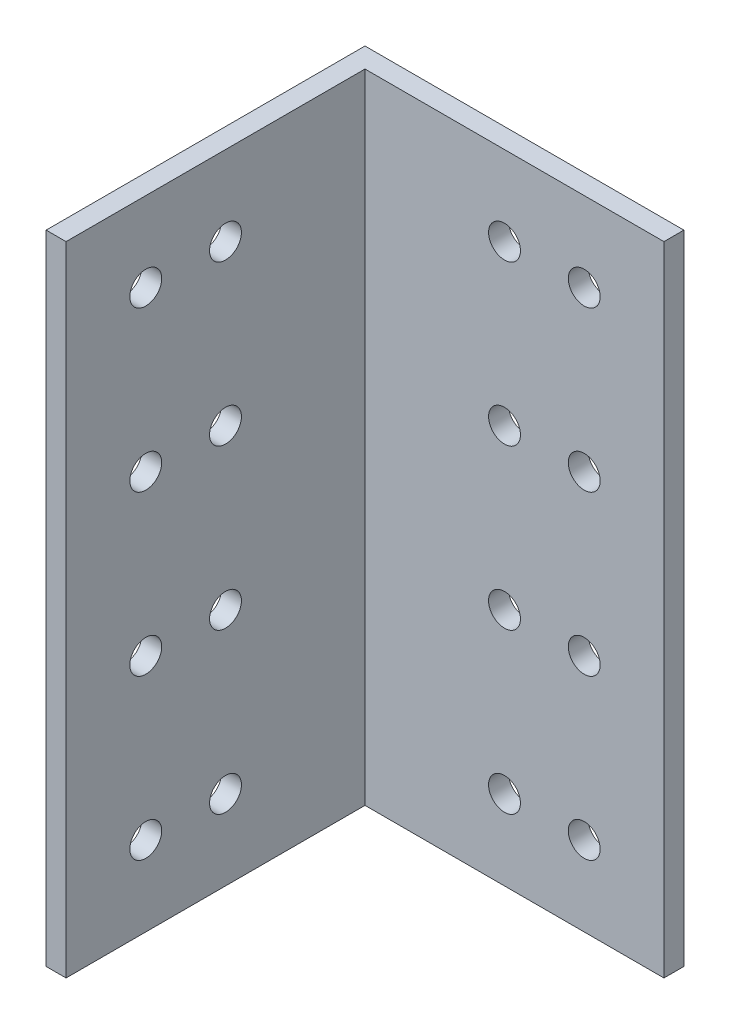
ISO-10303-21;
HEADER;
FILE_DESCRIPTION(('STEP AP214'),'2;1');
FILE_NAME('part.step','',(''),(''),'','','');
FILE_SCHEMA(('AUTOMOTIVE_DESIGN { 1 0 10303 214 1 1 1 1 }'));
ENDSEC;
DATA;
#1=APPLICATION_CONTEXT('core data for automotive mechanical design processes');
#2=APPLICATION_PROTOCOL_DEFINITION('international standard','automotive_design',2000,#1);
#3=PRODUCT_CONTEXT('',#1,'mechanical');
#4=PRODUCT('Part','Part','',(#3));
#5=PRODUCT_RELATED_PRODUCT_CATEGORY('part','',(#4));
#6=PRODUCT_DEFINITION_FORMATION('','',#4);
#7=PRODUCT_DEFINITION_CONTEXT('part definition',#1,'design');
#8=PRODUCT_DEFINITION('design','',#6,#7);
#9=PRODUCT_DEFINITION_SHAPE('','',#8);
#10=(LENGTH_UNIT() NAMED_UNIT(*) SI_UNIT(.MILLI.,.METRE.));
#11=(NAMED_UNIT(*) PLANE_ANGLE_UNIT() SI_UNIT($,.RADIAN.));
#12=(NAMED_UNIT(*) SI_UNIT($,.STERADIAN.) SOLID_ANGLE_UNIT());
#13=UNCERTAINTY_MEASURE_WITH_UNIT(LENGTH_MEASURE(1.E-05),#10,'distance_accuracy_value','');
#14=(GEOMETRIC_REPRESENTATION_CONTEXT(3) GLOBAL_UNCERTAINTY_ASSIGNED_CONTEXT((#13)) GLOBAL_UNIT_ASSIGNED_CONTEXT((#10,
#11,#12)) REPRESENTATION_CONTEXT('',''));
#15=CARTESIAN_POINT('',(0.,0.,0.));
#16=DIRECTION('',(0.,0.,1.));
#17=DIRECTION('',(1.,0.,0.));
#18=AXIS2_PLACEMENT_3D('',#15,#16,#17);
#19=CARTESIAN_POINT('',(-22.225,101.6,0.));
#20=DIRECTION('',(1.,0.,0.));
#21=DIRECTION('',(0.,0.,-1.));
#22=AXIS2_PLACEMENT_3D('',#19,#20,#21);
#23=PLANE('',#22);
#24=CARTESIAN_POINT('',(-22.225,38.1,12.7));
#25=DIRECTION('',(1.,0.,0.));
#26=DIRECTION('',(0.,0.,-1.));
#27=AXIS2_PLACEMENT_3D('',#24,#25,#26);
#28=CIRCLE('',#27,2.54);
#29=CARTESIAN_POINT('',(-22.225,38.1,10.16));
#30=VERTEX_POINT('',#29);
#31=EDGE_CURVE('E217',#30,#30,#28,.T.);
#32=ORIENTED_EDGE('',*,*,#31,.F.);
#33=EDGE_LOOP('',(#32));
#34=FACE_BOUND('',#33,.T.);
#35=CARTESIAN_POINT('',(-22.225,63.5,0.));
#36=DIRECTION('',(1.,0.,0.));
#37=DIRECTION('',(0.,0.,-1.));
#38=AXIS2_PLACEMENT_3D('',#35,#36,#37);
#39=CIRCLE('',#38,2.53999999999999);
#40=CARTESIAN_POINT('',(-22.225,63.5,-2.53999999999999));
#41=VERTEX_POINT('',#40);
#42=EDGE_CURVE('E224',#41,#41,#39,.T.);
#43=ORIENTED_EDGE('',*,*,#42,.F.);
#44=EDGE_LOOP('',(#43));
#45=FACE_BOUND('',#44,.T.);
#46=CARTESIAN_POINT('',(-22.225,63.5,12.7));
#47=DIRECTION('',(1.,0.,0.));
#48=DIRECTION('',(0.,0.,-1.));
#49=AXIS2_PLACEMENT_3D('',#46,#47,#48);
#50=CIRCLE('',#49,2.53999999999999);
#51=CARTESIAN_POINT('',(-22.225,63.5,10.16));
#52=VERTEX_POINT('',#51);
#53=EDGE_CURVE('E205',#52,#52,#50,.T.);
#54=ORIENTED_EDGE('',*,*,#53,.F.);
#55=EDGE_LOOP('',(#54));
#56=FACE_BOUND('',#55,.T.);
#57=CARTESIAN_POINT('',(-22.225,88.9,0.));
#58=DIRECTION('',(1.,0.,0.));
#59=DIRECTION('',(0.,0.,-1.));
#60=AXIS2_PLACEMENT_3D('',#57,#58,#59);
#61=CIRCLE('',#60,2.53999999999999);
#62=CARTESIAN_POINT('',(-22.225,88.9,-2.54));
#63=VERTEX_POINT('',#62);
#64=EDGE_CURVE('E212',#63,#63,#61,.T.);
#65=ORIENTED_EDGE('',*,*,#64,.F.);
#66=EDGE_LOOP('',(#65));
#67=FACE_BOUND('',#66,.T.);
#68=CARTESIAN_POINT('',(-22.225,12.7,0.));
#69=DIRECTION('',(1.,0.,0.));
#70=DIRECTION('',(0.,0.,-1.));
#71=AXIS2_PLACEMENT_3D('',#68,#69,#70);
#72=CIRCLE('',#71,2.54);
#73=CARTESIAN_POINT('',(-22.225,12.7,-2.54));
#74=VERTEX_POINT('',#73);
#75=EDGE_CURVE('E241',#74,#74,#72,.T.);
#76=ORIENTED_EDGE('',*,*,#75,.F.);
#77=EDGE_LOOP('',(#76));
#78=FACE_BOUND('',#77,.T.);
#79=CARTESIAN_POINT('',(-22.225,12.7,12.7));
#80=DIRECTION('',(1.,0.,0.));
#81=DIRECTION('',(0.,0.,-1.));
#82=AXIS2_PLACEMENT_3D('',#79,#80,#81);
#83=CIRCLE('',#82,2.54);
#84=CARTESIAN_POINT('',(-22.225,12.7,10.16));
#85=VERTEX_POINT('',#84);
#86=EDGE_CURVE('E229',#85,#85,#83,.T.);
#87=ORIENTED_EDGE('',*,*,#86,.F.);
#88=EDGE_LOOP('',(#87));
#89=FACE_BOUND('',#88,.T.);
#90=CARTESIAN_POINT('',(-22.225,38.1,0.));
#91=DIRECTION('',(1.,0.,0.));
#92=DIRECTION('',(0.,0.,-1.));
#93=AXIS2_PLACEMENT_3D('',#90,#91,#92);
#94=CIRCLE('',#93,2.54);
#95=CARTESIAN_POINT('',(-22.225,38.1,-2.54));
#96=VERTEX_POINT('',#95);
#97=EDGE_CURVE('E236',#96,#96,#94,.T.);
#98=ORIENTED_EDGE('',*,*,#97,.F.);
#99=EDGE_LOOP('',(#98));
#100=FACE_BOUND('',#99,.T.);
#101=CARTESIAN_POINT('',(-22.225,88.9,12.7));
#102=DIRECTION('',(1.,0.,0.));
#103=DIRECTION('',(0.,0.,-1.));
#104=AXIS2_PLACEMENT_3D('',#101,#102,#103);
#105=CIRCLE('',#104,2.54);
#106=CARTESIAN_POINT('',(-22.225,88.9,10.16));
#107=VERTEX_POINT('',#106);
#108=EDGE_CURVE('E199',#107,#107,#105,.T.);
#109=ORIENTED_EDGE('',*,*,#108,.F.);
#110=EDGE_LOOP('',(#109));
#111=FACE_BOUND('',#110,.T.);
#112=DIRECTION('',(0.,0.,1.));
#113=VECTOR('',#112,1.);
#114=CARTESIAN_POINT('',(-22.225,0.,0.));
#115=LINE('',#114,#113);
#116=CARTESIAN_POINT('',(-22.225,0.,-22.225));
#117=VERTEX_POINT('',#116);
#118=CARTESIAN_POINT('',(-22.225,0.,25.4));
#119=VERTEX_POINT('',#118);
#120=EDGE_CURVE('E120',#117,#119,#115,.T.);
#121=ORIENTED_EDGE('',*,*,#120,.F.);
#122=DIRECTION('',(0.,-1.,0.));
#123=VECTOR('',#122,1.);
#124=CARTESIAN_POINT('',(-22.225,101.6,-22.225));
#125=LINE('',#124,#123);
#126=CARTESIAN_POINT('',(-22.225,101.6,-22.225));
#127=VERTEX_POINT('',#126);
#128=EDGE_CURVE('E11',#127,#117,#125,.T.);
#129=ORIENTED_EDGE('',*,*,#128,.F.);
#130=DIRECTION('',(0.,0.,1.));
#131=VECTOR('',#130,1.);
#132=CARTESIAN_POINT('',(-22.225,101.6,0.));
#133=LINE('',#132,#131);
#134=CARTESIAN_POINT('',(-22.225,101.6,25.4));
#135=VERTEX_POINT('',#134);
#136=EDGE_CURVE('E134',#127,#135,#133,.T.);
#137=ORIENTED_EDGE('',*,*,#136,.T.);
#138=DIRECTION('',(0.,-1.,0.));
#139=VECTOR('',#138,1.);
#140=CARTESIAN_POINT('',(-22.225,101.6,25.4));
#141=LINE('',#140,#139);
#142=EDGE_CURVE('E83',#135,#119,#141,.T.);
#143=ORIENTED_EDGE('',*,*,#142,.T.);
#144=EDGE_LOOP('',(#121,#129,#137,#143));
#145=FACE_BOUND('',#144,.T.);
#146=ADVANCED_FACE('F39',(#34,#45,#56,#67,#78,#89,#100,#111,#145),#23,.T.);
#147=CARTESIAN_POINT('',(0.,101.6,-22.225));
#148=DIRECTION('',(0.,0.,-1.));
#149=DIRECTION('',(-1.,0.,0.));
#150=AXIS2_PLACEMENT_3D('',#147,#148,#149);
#151=PLANE('',#150);
#152=CARTESIAN_POINT('',(0.,38.1,-22.225));
#153=DIRECTION('',(0.,0.,1.));
#154=DIRECTION('',(1.,0.,0.));
#155=AXIS2_PLACEMENT_3D('',#152,#153,#154);
#156=CIRCLE('',#155,2.54);
#157=CARTESIAN_POINT('',(2.54,38.1,-22.225));
#158=VERTEX_POINT('',#157);
#159=EDGE_CURVE('E169',#158,#158,#156,.T.);
#160=ORIENTED_EDGE('',*,*,#159,.F.);
#161=EDGE_LOOP('',(#160));
#162=FACE_BOUND('',#161,.T.);
#163=CARTESIAN_POINT('',(12.7,63.5,-22.225));
#164=DIRECTION('',(0.,0.,1.));
#165=DIRECTION('',(1.,0.,0.));
#166=AXIS2_PLACEMENT_3D('',#163,#164,#165);
#167=CIRCLE('',#166,2.54);
#168=CARTESIAN_POINT('',(15.24,63.5,-22.225));
#169=VERTEX_POINT('',#168);
#170=EDGE_CURVE('E176',#169,#169,#167,.T.);
#171=ORIENTED_EDGE('',*,*,#170,.F.);
#172=EDGE_LOOP('',(#171));
#173=FACE_BOUND('',#172,.T.);
#174=CARTESIAN_POINT('',(0.,63.5,-22.225));
#175=DIRECTION('',(0.,0.,1.));
#176=DIRECTION('',(1.,0.,0.));
#177=AXIS2_PLACEMENT_3D('',#174,#175,#176);
#178=CIRCLE('',#177,2.53999999999999);
#179=CARTESIAN_POINT('',(2.53999999999999,63.5,-22.225));
#180=VERTEX_POINT('',#179);
#181=EDGE_CURVE('E157',#180,#180,#178,.T.);
#182=ORIENTED_EDGE('',*,*,#181,.F.);
#183=EDGE_LOOP('',(#182));
#184=FACE_BOUND('',#183,.T.);
#185=CARTESIAN_POINT('',(0.,88.9,-22.225));
#186=DIRECTION('',(0.,0.,1.));
#187=DIRECTION('',(1.,0.,0.));
#188=AXIS2_PLACEMENT_3D('',#185,#186,#187);
#189=CIRCLE('',#188,2.53999999999999);
#190=CARTESIAN_POINT('',(2.53999999999999,88.9,-22.225));
#191=VERTEX_POINT('',#190);
#192=EDGE_CURVE('E164',#191,#191,#189,.T.);
#193=ORIENTED_EDGE('',*,*,#192,.F.);
#194=EDGE_LOOP('',(#193));
#195=FACE_BOUND('',#194,.T.);
#196=CARTESIAN_POINT('',(12.7,12.7,-22.225));
#197=DIRECTION('',(0.,0.,1.));
#198=DIRECTION('',(1.,0.,0.));
#199=AXIS2_PLACEMENT_3D('',#196,#197,#198);
#200=CIRCLE('',#199,2.54);
#201=CARTESIAN_POINT('',(15.24,12.7,-22.225));
#202=VERTEX_POINT('',#201);
#203=EDGE_CURVE('E193',#202,#202,#200,.T.);
#204=ORIENTED_EDGE('',*,*,#203,.F.);
#205=EDGE_LOOP('',(#204));
#206=FACE_BOUND('',#205,.T.);
#207=CARTESIAN_POINT('',(0.,12.7,-22.225));
#208=DIRECTION('',(0.,0.,1.));
#209=DIRECTION('',(1.,0.,0.));
#210=AXIS2_PLACEMENT_3D('',#207,#208,#209);
#211=CIRCLE('',#210,2.54);
#212=CARTESIAN_POINT('',(2.54,12.7,-22.225));
#213=VERTEX_POINT('',#212);
#214=EDGE_CURVE('E181',#213,#213,#211,.T.);
#215=ORIENTED_EDGE('',*,*,#214,.F.);
#216=EDGE_LOOP('',(#215));
#217=FACE_BOUND('',#216,.T.);
#218=CARTESIAN_POINT('',(12.7,38.1,-22.225));
#219=DIRECTION('',(0.,0.,1.));
#220=DIRECTION('',(1.,0.,0.));
#221=AXIS2_PLACEMENT_3D('',#218,#219,#220);
#222=CIRCLE('',#221,2.54);
#223=CARTESIAN_POINT('',(15.24,38.1,-22.225));
#224=VERTEX_POINT('',#223);
#225=EDGE_CURVE('E188',#224,#224,#222,.T.);
#226=ORIENTED_EDGE('',*,*,#225,.F.);
#227=EDGE_LOOP('',(#226));
#228=FACE_BOUND('',#227,.T.);
#229=CARTESIAN_POINT('',(12.7,88.9,-22.225));
#230=DIRECTION('',(0.,0.,1.));
#231=DIRECTION('',(1.,0.,0.));
#232=AXIS2_PLACEMENT_3D('',#229,#230,#231);
#233=CIRCLE('',#232,2.53999999999999);
#234=CARTESIAN_POINT('',(15.24,88.9,-22.225));
#235=VERTEX_POINT('',#234);
#236=EDGE_CURVE('E151',#235,#235,#233,.T.);
#237=ORIENTED_EDGE('',*,*,#236,.F.);
#238=EDGE_LOOP('',(#237));
#239=FACE_BOUND('',#238,.T.);
#240=DIRECTION('',(1.,0.,0.));
#241=VECTOR('',#240,1.);
#242=CARTESIAN_POINT('',(0.,0.,-22.225));
#243=LINE('',#242,#241);
#244=CARTESIAN_POINT('',(25.4,0.,-22.225));
#245=VERTEX_POINT('',#244);
#246=EDGE_CURVE('E123',#117,#245,#243,.T.);
#247=ORIENTED_EDGE('',*,*,#246,.T.);
#248=DIRECTION('',(0.,-1.,0.));
#249=VECTOR('',#248,1.);
#250=CARTESIAN_POINT('',(25.4,101.6,-22.225));
#251=LINE('',#250,#249);
#252=CARTESIAN_POINT('',(25.4,101.6,-22.225));
#253=VERTEX_POINT('',#252);
#254=EDGE_CURVE('E47',#253,#245,#251,.T.);
#255=ORIENTED_EDGE('',*,*,#254,.F.);
#256=DIRECTION('',(1.,0.,0.));
#257=VECTOR('',#256,1.);
#258=CARTESIAN_POINT('',(0.,101.6,-22.225));
#259=LINE('',#258,#257);
#260=EDGE_CURVE('E147',#127,#253,#259,.T.);
#261=ORIENTED_EDGE('',*,*,#260,.F.);
#262=ORIENTED_EDGE('',*,*,#128,.T.);
#263=EDGE_LOOP('',(#247,#255,#261,#262));
#264=FACE_BOUND('',#263,.T.);
#265=ADVANCED_FACE('F259',(#162,#173,#184,#195,#206,#217,#228,#239,#264),#151,.F.);
#266=CARTESIAN_POINT('',(25.4,101.6,0.));
#267=DIRECTION('',(-1.,0.,0.));
#268=DIRECTION('',(0.,0.,1.));
#269=AXIS2_PLACEMENT_3D('',#266,#267,#268);
#270=PLANE('',#269);
#271=DIRECTION('',(0.,0.,-1.));
#272=VECTOR('',#271,1.);
#273=CARTESIAN_POINT('',(25.4,0.,0.));
#274=LINE('',#273,#272);
#275=CARTESIAN_POINT('',(25.4,0.,-25.4));
#276=VERTEX_POINT('',#275);
#277=EDGE_CURVE('E126',#245,#276,#274,.T.);
#278=ORIENTED_EDGE('',*,*,#277,.T.);
#279=DIRECTION('',(0.,-1.,0.));
#280=VECTOR('',#279,1.);
#281=CARTESIAN_POINT('',(25.4,101.6,-25.4));
#282=LINE('',#281,#280);
#283=CARTESIAN_POINT('',(25.4,101.6,-25.4));
#284=VERTEX_POINT('',#283);
#285=EDGE_CURVE('E107',#284,#276,#282,.T.);
#286=ORIENTED_EDGE('',*,*,#285,.F.);
#287=DIRECTION('',(0.,0.,-1.));
#288=VECTOR('',#287,1.);
#289=CARTESIAN_POINT('',(25.4,101.6,0.));
#290=LINE('',#289,#288);
#291=EDGE_CURVE('E112',#253,#284,#290,.T.);
#292=ORIENTED_EDGE('',*,*,#291,.F.);
#293=ORIENTED_EDGE('',*,*,#254,.T.);
#294=EDGE_LOOP('',(#278,#286,#292,#293));
#295=FACE_BOUND('',#294,.T.);
#296=ADVANCED_FACE('F141',(#295),#270,.F.);
#297=CARTESIAN_POINT('',(0.,101.6,-25.4));
#298=DIRECTION('',(0.,0.,-1.));
#299=DIRECTION('',(-1.,0.,0.));
#300=AXIS2_PLACEMENT_3D('',#297,#298,#299);
#301=PLANE('',#300);
#302=CARTESIAN_POINT('',(0.,38.1,-25.4));
#303=DIRECTION('',(0.,0.,1.));
#304=DIRECTION('',(1.,0.,0.));
#305=AXIS2_PLACEMENT_3D('',#302,#303,#304);
#306=CIRCLE('',#305,2.54);
#307=CARTESIAN_POINT('',(2.54,38.1,-25.4));
#308=VERTEX_POINT('',#307);
#309=EDGE_CURVE('E172',#308,#308,#306,.T.);
#310=ORIENTED_EDGE('',*,*,#309,.T.);
#311=EDGE_LOOP('',(#310));
#312=FACE_BOUND('',#311,.T.);
#313=CARTESIAN_POINT('',(12.7,63.5,-25.4));
#314=DIRECTION('',(0.,0.,1.));
#315=DIRECTION('',(1.,0.,0.));
#316=AXIS2_PLACEMENT_3D('',#313,#314,#315);
#317=CIRCLE('',#316,2.54);
#318=CARTESIAN_POINT('',(15.24,63.5,-25.4));
#319=VERTEX_POINT('',#318);
#320=EDGE_CURVE('E161',#319,#319,#317,.T.);
#321=ORIENTED_EDGE('',*,*,#320,.T.);
#322=EDGE_LOOP('',(#321));
#323=FACE_BOUND('',#322,.T.);
#324=CARTESIAN_POINT('',(0.,63.5,-25.4));
#325=DIRECTION('',(0.,0.,1.));
#326=DIRECTION('',(1.,0.,0.));
#327=AXIS2_PLACEMENT_3D('',#324,#325,#326);
#328=CIRCLE('',#327,2.53999999999999);
#329=CARTESIAN_POINT('',(2.53999999999999,63.5,-25.4));
#330=VERTEX_POINT('',#329);
#331=EDGE_CURVE('E160',#330,#330,#328,.T.);
#332=ORIENTED_EDGE('',*,*,#331,.T.);
#333=EDGE_LOOP('',(#332));
#334=FACE_BOUND('',#333,.T.);
#335=CARTESIAN_POINT('',(0.,88.9,-25.4));
#336=DIRECTION('',(0.,0.,1.));
#337=DIRECTION('',(1.,0.,0.));
#338=AXIS2_PLACEMENT_3D('',#335,#336,#337);
#339=CIRCLE('',#338,2.53999999999999);
#340=CARTESIAN_POINT('',(2.53999999999999,88.9,-25.4));
#341=VERTEX_POINT('',#340);
#342=EDGE_CURVE('E154',#341,#341,#339,.T.);
#343=ORIENTED_EDGE('',*,*,#342,.T.);
#344=EDGE_LOOP('',(#343));
#345=FACE_BOUND('',#344,.T.);
#346=CARTESIAN_POINT('',(12.7,12.7,-25.4));
#347=DIRECTION('',(0.,0.,1.));
#348=DIRECTION('',(1.,0.,0.));
#349=AXIS2_PLACEMENT_3D('',#346,#347,#348);
#350=CIRCLE('',#349,2.54);
#351=CARTESIAN_POINT('',(15.24,12.7,-25.4));
#352=VERTEX_POINT('',#351);
#353=EDGE_CURVE('E185',#352,#352,#350,.T.);
#354=ORIENTED_EDGE('',*,*,#353,.T.);
#355=EDGE_LOOP('',(#354));
#356=FACE_BOUND('',#355,.T.);
#357=CARTESIAN_POINT('',(0.,12.7,-25.4));
#358=DIRECTION('',(0.,0.,1.));
#359=DIRECTION('',(1.,0.,0.));
#360=AXIS2_PLACEMENT_3D('',#357,#358,#359);
#361=CIRCLE('',#360,2.54);
#362=CARTESIAN_POINT('',(2.54,12.7,-25.4));
#363=VERTEX_POINT('',#362);
#364=EDGE_CURVE('E184',#363,#363,#361,.T.);
#365=ORIENTED_EDGE('',*,*,#364,.T.);
#366=EDGE_LOOP('',(#365));
#367=FACE_BOUND('',#366,.T.);
#368=CARTESIAN_POINT('',(12.7,38.1,-25.4));
#369=DIRECTION('',(0.,0.,1.));
#370=DIRECTION('',(1.,0.,0.));
#371=AXIS2_PLACEMENT_3D('',#368,#369,#370);
#372=CIRCLE('',#371,2.54);
#373=CARTESIAN_POINT('',(15.24,38.1,-25.4));
#374=VERTEX_POINT('',#373);
#375=EDGE_CURVE('E173',#374,#374,#372,.T.);
#376=ORIENTED_EDGE('',*,*,#375,.T.);
#377=EDGE_LOOP('',(#376));
#378=FACE_BOUND('',#377,.T.);
#379=CARTESIAN_POINT('',(12.7,88.9,-25.4));
#380=DIRECTION('',(0.,0.,1.));
#381=DIRECTION('',(1.,0.,0.));
#382=AXIS2_PLACEMENT_3D('',#379,#380,#381);
#383=CIRCLE('',#382,2.53999999999999);
#384=CARTESIAN_POINT('',(15.24,88.9,-25.4));
#385=VERTEX_POINT('',#384);
#386=EDGE_CURVE('E124',#385,#385,#383,.T.);
#387=ORIENTED_EDGE('',*,*,#386,.T.);
#388=EDGE_LOOP('',(#387));
#389=FACE_BOUND('',#388,.T.);
#390=DIRECTION('',(1.,0.,0.));
#391=VECTOR('',#390,1.);
#392=CARTESIAN_POINT('',(0.,0.,-25.4));
#393=LINE('',#392,#391);
#394=CARTESIAN_POINT('',(-25.4,0.,-25.4));
#395=VERTEX_POINT('',#394);
#396=EDGE_CURVE('E102',#395,#276,#393,.T.);
#397=ORIENTED_EDGE('',*,*,#396,.F.);
#398=DIRECTION('',(0.,-1.,0.));
#399=VECTOR('',#398,1.);
#400=CARTESIAN_POINT('',(-25.4,101.6,-25.4));
#401=LINE('',#400,#399);
#402=CARTESIAN_POINT('',(-25.4,101.6,-25.4));
#403=VERTEX_POINT('',#402);
#404=EDGE_CURVE('E97',#403,#395,#401,.T.);
#405=ORIENTED_EDGE('',*,*,#404,.F.);
#406=DIRECTION('',(1.,0.,0.));
#407=VECTOR('',#406,1.);
#408=CARTESIAN_POINT('',(0.,101.6,-25.4));
#409=LINE('',#408,#407);
#410=EDGE_CURVE('E100',#403,#284,#409,.T.);
#411=ORIENTED_EDGE('',*,*,#410,.T.);
#412=ORIENTED_EDGE('',*,*,#285,.T.);
#413=EDGE_LOOP('',(#397,#405,#411,#412));
#414=FACE_BOUND('',#413,.T.);
#415=ADVANCED_FACE('F99',(#312,#323,#334,#345,#356,#367,#378,#389,#414),#301,.T.);
#416=CARTESIAN_POINT('',(-25.4,101.6,0.));
#417=DIRECTION('',(-1.,0.,0.));
#418=DIRECTION('',(0.,0.,1.));
#419=AXIS2_PLACEMENT_3D('',#416,#417,#418);
#420=PLANE('',#419);
#421=CARTESIAN_POINT('',(-25.4,38.1,12.7));
#422=DIRECTION('',(1.,0.,0.));
#423=DIRECTION('',(0.,0.,-1.));
#424=AXIS2_PLACEMENT_3D('',#421,#422,#423);
#425=CIRCLE('',#424,2.54);
#426=CARTESIAN_POINT('',(-25.4,38.1,10.16));
#427=VERTEX_POINT('',#426);
#428=EDGE_CURVE('E220',#427,#427,#425,.T.);
#429=ORIENTED_EDGE('',*,*,#428,.T.);
#430=EDGE_LOOP('',(#429));
#431=FACE_BOUND('',#430,.T.);
#432=CARTESIAN_POINT('',(-25.4,63.5,0.));
#433=DIRECTION('',(1.,0.,0.));
#434=DIRECTION('',(0.,0.,-1.));
#435=AXIS2_PLACEMENT_3D('',#432,#433,#434);
#436=CIRCLE('',#435,2.53999999999999);
#437=CARTESIAN_POINT('',(-25.4,63.5,-2.53999999999999));
#438=VERTEX_POINT('',#437);
#439=EDGE_CURVE('E209',#438,#438,#436,.T.);
#440=ORIENTED_EDGE('',*,*,#439,.T.);
#441=EDGE_LOOP('',(#440));
#442=FACE_BOUND('',#441,.T.);
#443=CARTESIAN_POINT('',(-25.4,63.5,12.7));
#444=DIRECTION('',(1.,0.,0.));
#445=DIRECTION('',(0.,0.,-1.));
#446=AXIS2_PLACEMENT_3D('',#443,#444,#445);
#447=CIRCLE('',#446,2.53999999999999);
#448=CARTESIAN_POINT('',(-25.4,63.5,10.16));
#449=VERTEX_POINT('',#448);
#450=EDGE_CURVE('E208',#449,#449,#447,.T.);
#451=ORIENTED_EDGE('',*,*,#450,.T.);
#452=EDGE_LOOP('',(#451));
#453=FACE_BOUND('',#452,.T.);
#454=CARTESIAN_POINT('',(-25.4,88.9,0.));
#455=DIRECTION('',(1.,0.,0.));
#456=DIRECTION('',(0.,0.,-1.));
#457=AXIS2_PLACEMENT_3D('',#454,#455,#456);
#458=CIRCLE('',#457,2.53999999999999);
#459=CARTESIAN_POINT('',(-25.4,88.9,-2.54));
#460=VERTEX_POINT('',#459);
#461=EDGE_CURVE('E202',#460,#460,#458,.T.);
#462=ORIENTED_EDGE('',*,*,#461,.T.);
#463=EDGE_LOOP('',(#462));
#464=FACE_BOUND('',#463,.T.);
#465=CARTESIAN_POINT('',(-25.4,12.7,0.));
#466=DIRECTION('',(1.,0.,0.));
#467=DIRECTION('',(0.,0.,-1.));
#468=AXIS2_PLACEMENT_3D('',#465,#466,#467);
#469=CIRCLE('',#468,2.54);
#470=CARTESIAN_POINT('',(-25.4,12.7,-2.54));
#471=VERTEX_POINT('',#470);
#472=EDGE_CURVE('E233',#471,#471,#469,.T.);
#473=ORIENTED_EDGE('',*,*,#472,.T.);
#474=EDGE_LOOP('',(#473));
#475=FACE_BOUND('',#474,.T.);
#476=CARTESIAN_POINT('',(-25.4,12.7,12.7));
#477=DIRECTION('',(1.,0.,0.));
#478=DIRECTION('',(0.,0.,-1.));
#479=AXIS2_PLACEMENT_3D('',#476,#477,#478);
#480=CIRCLE('',#479,2.54);
#481=CARTESIAN_POINT('',(-25.4,12.7,10.16));
#482=VERTEX_POINT('',#481);
#483=EDGE_CURVE('E232',#482,#482,#480,.T.);
#484=ORIENTED_EDGE('',*,*,#483,.T.);
#485=EDGE_LOOP('',(#484));
#486=FACE_BOUND('',#485,.T.);
#487=CARTESIAN_POINT('',(-25.4,38.1,0.));
#488=DIRECTION('',(1.,0.,0.));
#489=DIRECTION('',(0.,0.,-1.));
#490=AXIS2_PLACEMENT_3D('',#487,#488,#489);
#491=CIRCLE('',#490,2.54);
#492=CARTESIAN_POINT('',(-25.4,38.1,-2.54));
#493=VERTEX_POINT('',#492);
#494=EDGE_CURVE('E221',#493,#493,#491,.T.);
#495=ORIENTED_EDGE('',*,*,#494,.T.);
#496=EDGE_LOOP('',(#495));
#497=FACE_BOUND('',#496,.T.);
#498=CARTESIAN_POINT('',(-25.4,88.9,12.7));
#499=DIRECTION('',(1.,0.,0.));
#500=DIRECTION('',(0.,0.,-1.));
#501=AXIS2_PLACEMENT_3D('',#498,#499,#500);
#502=CIRCLE('',#501,2.54);
#503=CARTESIAN_POINT('',(-25.4,88.9,10.16));
#504=VERTEX_POINT('',#503);
#505=EDGE_CURVE('E196',#504,#504,#502,.T.);
#506=ORIENTED_EDGE('',*,*,#505,.T.);
#507=EDGE_LOOP('',(#506));
#508=FACE_BOUND('',#507,.T.);
#509=DIRECTION('',(0.,0.,-1.));
#510=VECTOR('',#509,1.);
#511=CARTESIAN_POINT('',(-25.4,0.,0.));
#512=LINE('',#511,#510);
#513=CARTESIAN_POINT('',(-25.4,0.,25.4));
#514=VERTEX_POINT('',#513);
#515=EDGE_CURVE('E130',#514,#395,#512,.T.);
#516=ORIENTED_EDGE('',*,*,#515,.F.);
#517=DIRECTION('',(0.,-1.,0.));
#518=VECTOR('',#517,1.);
#519=CARTESIAN_POINT('',(-25.4,101.6,25.4));
#520=LINE('',#519,#518);
#521=CARTESIAN_POINT('',(-25.4,101.6,25.4));
#522=VERTEX_POINT('',#521);
#523=EDGE_CURVE('E76',#522,#514,#520,.T.);
#524=ORIENTED_EDGE('',*,*,#523,.F.);
#525=DIRECTION('',(0.,0.,-1.));
#526=VECTOR('',#525,1.);
#527=CARTESIAN_POINT('',(-25.4,101.6,0.));
#528=LINE('',#527,#526);
#529=EDGE_CURVE('E110',#522,#403,#528,.T.);
#530=ORIENTED_EDGE('',*,*,#529,.T.);
#531=ORIENTED_EDGE('',*,*,#404,.T.);
#532=EDGE_LOOP('',(#516,#524,#530,#531));
#533=FACE_BOUND('',#532,.T.);
#534=ADVANCED_FACE('F115',(#431,#442,#453,#464,#475,#486,#497,#508,#533),#420,.T.);
#535=CARTESIAN_POINT('',(0.,101.6,25.4));
#536=DIRECTION('',(0.,0.,-1.));
#537=DIRECTION('',(-1.,0.,0.));
#538=AXIS2_PLACEMENT_3D('',#535,#536,#537);
#539=PLANE('',#538);
#540=DIRECTION('',(1.,0.,0.));
#541=VECTOR('',#540,1.);
#542=CARTESIAN_POINT('',(0.,0.,25.4));
#543=LINE('',#542,#541);
#544=EDGE_CURVE('E132',#514,#119,#543,.T.);
#545=ORIENTED_EDGE('',*,*,#544,.T.);
#546=ORIENTED_EDGE('',*,*,#142,.F.);
#547=DIRECTION('',(1.,0.,0.));
#548=VECTOR('',#547,1.);
#549=CARTESIAN_POINT('',(0.,101.6,25.4));
#550=LINE('',#549,#548);
#551=EDGE_CURVE('E55',#522,#135,#550,.T.);
#552=ORIENTED_EDGE('',*,*,#551,.F.);
#553=ORIENTED_EDGE('',*,*,#523,.T.);
#554=EDGE_LOOP('',(#545,#546,#552,#553));
#555=FACE_BOUND('',#554,.T.);
#556=ADVANCED_FACE('F146',(#555),#539,.F.);
#557=CARTESIAN_POINT('',(0.,101.6,0.));
#558=DIRECTION('',(0.,1.,0.));
#559=DIRECTION('',(0.,0.,1.));
#560=AXIS2_PLACEMENT_3D('',#557,#558,#559);
#561=PLANE('',#560);
#562=ORIENTED_EDGE('',*,*,#136,.F.);
#563=ORIENTED_EDGE('',*,*,#260,.T.);
#564=ORIENTED_EDGE('',*,*,#291,.T.);
#565=ORIENTED_EDGE('',*,*,#410,.F.);
#566=ORIENTED_EDGE('',*,*,#529,.F.);
#567=ORIENTED_EDGE('',*,*,#551,.T.);
#568=EDGE_LOOP('',(#562,#563,#564,#565,#566,#567));
#569=FACE_BOUND('',#568,.T.);
#570=ADVANCED_FACE('F109',(#569),#561,.T.);
#571=CARTESIAN_POINT('',(0.,0.,0.));
#572=DIRECTION('',(0.,1.,0.));
#573=DIRECTION('',(0.,0.,1.));
#574=AXIS2_PLACEMENT_3D('',#571,#572,#573);
#575=PLANE('',#574);
#576=ORIENTED_EDGE('',*,*,#120,.T.);
#577=ORIENTED_EDGE('',*,*,#544,.F.);
#578=ORIENTED_EDGE('',*,*,#515,.T.);
#579=ORIENTED_EDGE('',*,*,#396,.T.);
#580=ORIENTED_EDGE('',*,*,#277,.F.);
#581=ORIENTED_EDGE('',*,*,#246,.F.);
#582=EDGE_LOOP('',(#576,#577,#578,#579,#580,#581));
#583=FACE_BOUND('',#582,.T.);
#584=ADVANCED_FACE('F145',(#583),#575,.F.);
#585=CARTESIAN_POINT('',(12.7,88.9,-25.4));
#586=DIRECTION('',(0.,0.,1.));
#587=DIRECTION('',(1.,0.,0.));
#588=AXIS2_PLACEMENT_3D('',#585,#586,#587);
#589=CYLINDRICAL_SURFACE('',#588,2.53999999999999);
#590=ORIENTED_EDGE('',*,*,#386,.F.);
#591=EDGE_LOOP('',(#590));
#592=FACE_BOUND('',#591,.T.);
#593=ORIENTED_EDGE('',*,*,#236,.T.);
#594=EDGE_LOOP('',(#593));
#595=FACE_BOUND('',#594,.T.);
#596=ADVANCED_FACE('F296',(#592,#595),#589,.F.);
#597=CARTESIAN_POINT('',(12.7,38.1,-25.4));
#598=DIRECTION('',(0.,0.,1.));
#599=DIRECTION('',(1.,0.,0.));
#600=AXIS2_PLACEMENT_3D('',#597,#598,#599);
#601=CYLINDRICAL_SURFACE('',#600,2.54);
#602=ORIENTED_EDGE('',*,*,#375,.F.);
#603=EDGE_LOOP('',(#602));
#604=FACE_BOUND('',#603,.T.);
#605=ORIENTED_EDGE('',*,*,#225,.T.);
#606=EDGE_LOOP('',(#605));
#607=FACE_BOUND('',#606,.T.);
#608=ADVANCED_FACE('F293',(#604,#607),#601,.F.);
#609=CARTESIAN_POINT('',(0.,12.7,-25.4));
#610=DIRECTION('',(0.,0.,1.));
#611=DIRECTION('',(1.,0.,0.));
#612=AXIS2_PLACEMENT_3D('',#609,#610,#611);
#613=CYLINDRICAL_SURFACE('',#612,2.54);
#614=ORIENTED_EDGE('',*,*,#364,.F.);
#615=EDGE_LOOP('',(#614));
#616=FACE_BOUND('',#615,.T.);
#617=ORIENTED_EDGE('',*,*,#214,.T.);
#618=EDGE_LOOP('',(#617));
#619=FACE_BOUND('',#618,.T.);
#620=ADVANCED_FACE('F291',(#616,#619),#613,.F.);
#621=CARTESIAN_POINT('',(12.7,12.7,-25.4));
#622=DIRECTION('',(0.,0.,1.));
#623=DIRECTION('',(1.,0.,0.));
#624=AXIS2_PLACEMENT_3D('',#621,#622,#623);
#625=CYLINDRICAL_SURFACE('',#624,2.54);
#626=ORIENTED_EDGE('',*,*,#353,.F.);
#627=EDGE_LOOP('',(#626));
#628=FACE_BOUND('',#627,.T.);
#629=ORIENTED_EDGE('',*,*,#203,.T.);
#630=EDGE_LOOP('',(#629));
#631=FACE_BOUND('',#630,.T.);
#632=ADVANCED_FACE('F287',(#628,#631),#625,.F.);
#633=CARTESIAN_POINT('',(0.,88.9,-25.4));
#634=DIRECTION('',(0.,0.,1.));
#635=DIRECTION('',(1.,0.,0.));
#636=AXIS2_PLACEMENT_3D('',#633,#634,#635);
#637=CYLINDRICAL_SURFACE('',#636,2.53999999999999);
#638=ORIENTED_EDGE('',*,*,#342,.F.);
#639=EDGE_LOOP('',(#638));
#640=FACE_BOUND('',#639,.T.);
#641=ORIENTED_EDGE('',*,*,#192,.T.);
#642=EDGE_LOOP('',(#641));
#643=FACE_BOUND('',#642,.T.);
#644=ADVANCED_FACE('F290',(#640,#643),#637,.F.);
#645=CARTESIAN_POINT('',(0.,63.5,-25.4));
#646=DIRECTION('',(0.,0.,1.));
#647=DIRECTION('',(1.,0.,0.));
#648=AXIS2_PLACEMENT_3D('',#645,#646,#647);
#649=CYLINDRICAL_SURFACE('',#648,2.53999999999999);
#650=ORIENTED_EDGE('',*,*,#331,.F.);
#651=EDGE_LOOP('',(#650));
#652=FACE_BOUND('',#651,.T.);
#653=ORIENTED_EDGE('',*,*,#181,.T.);
#654=EDGE_LOOP('',(#653));
#655=FACE_BOUND('',#654,.T.);
#656=ADVANCED_FACE('F302',(#652,#655),#649,.F.);
#657=CARTESIAN_POINT('',(12.7,63.5,-25.4));
#658=DIRECTION('',(0.,0.,1.));
#659=DIRECTION('',(1.,0.,0.));
#660=AXIS2_PLACEMENT_3D('',#657,#658,#659);
#661=CYLINDRICAL_SURFACE('',#660,2.54);
#662=ORIENTED_EDGE('',*,*,#320,.F.);
#663=EDGE_LOOP('',(#662));
#664=FACE_BOUND('',#663,.T.);
#665=ORIENTED_EDGE('',*,*,#170,.T.);
#666=EDGE_LOOP('',(#665));
#667=FACE_BOUND('',#666,.T.);
#668=ADVANCED_FACE('F279',(#664,#667),#661,.F.);
#669=CARTESIAN_POINT('',(0.,38.1,-25.4));
#670=DIRECTION('',(0.,0.,1.));
#671=DIRECTION('',(1.,0.,0.));
#672=AXIS2_PLACEMENT_3D('',#669,#670,#671);
#673=CYLINDRICAL_SURFACE('',#672,2.54);
#674=ORIENTED_EDGE('',*,*,#309,.F.);
#675=EDGE_LOOP('',(#674));
#676=FACE_BOUND('',#675,.T.);
#677=ORIENTED_EDGE('',*,*,#159,.T.);
#678=EDGE_LOOP('',(#677));
#679=FACE_BOUND('',#678,.T.);
#680=ADVANCED_FACE('F270',(#676,#679),#673,.F.);
#681=CARTESIAN_POINT('',(-25.4,88.9,12.7));
#682=DIRECTION('',(1.,0.,0.));
#683=DIRECTION('',(0.,0.,-1.));
#684=AXIS2_PLACEMENT_3D('',#681,#682,#683);
#685=CYLINDRICAL_SURFACE('',#684,2.54);
#686=ORIENTED_EDGE('',*,*,#505,.F.);
#687=EDGE_LOOP('',(#686));
#688=FACE_BOUND('',#687,.T.);
#689=ORIENTED_EDGE('',*,*,#108,.T.);
#690=EDGE_LOOP('',(#689));
#691=FACE_BOUND('',#690,.T.);
#692=ADVANCED_FACE('F267',(#688,#691),#685,.F.);
#693=CARTESIAN_POINT('',(-25.4,38.1,0.));
#694=DIRECTION('',(1.,0.,0.));
#695=DIRECTION('',(0.,0.,-1.));
#696=AXIS2_PLACEMENT_3D('',#693,#694,#695);
#697=CYLINDRICAL_SURFACE('',#696,2.54);
#698=ORIENTED_EDGE('',*,*,#494,.F.);
#699=EDGE_LOOP('',(#698));
#700=FACE_BOUND('',#699,.T.);
#701=ORIENTED_EDGE('',*,*,#97,.T.);
#702=EDGE_LOOP('',(#701));
#703=FACE_BOUND('',#702,.T.);
#704=ADVANCED_FACE('F269',(#700,#703),#697,.F.);
#705=CARTESIAN_POINT('',(-25.4,12.7,12.7));
#706=DIRECTION('',(1.,0.,0.));
#707=DIRECTION('',(0.,0.,-1.));
#708=AXIS2_PLACEMENT_3D('',#705,#706,#707);
#709=CYLINDRICAL_SURFACE('',#708,2.54);
#710=ORIENTED_EDGE('',*,*,#483,.F.);
#711=EDGE_LOOP('',(#710));
#712=FACE_BOUND('',#711,.T.);
#713=ORIENTED_EDGE('',*,*,#86,.T.);
#714=EDGE_LOOP('',(#713));
#715=FACE_BOUND('',#714,.T.);
#716=ADVANCED_FACE('F253',(#712,#715),#709,.F.);
#717=CARTESIAN_POINT('',(-25.4,12.7,0.));
#718=DIRECTION('',(1.,0.,0.));
#719=DIRECTION('',(0.,0.,-1.));
#720=AXIS2_PLACEMENT_3D('',#717,#718,#719);
#721=CYLINDRICAL_SURFACE('',#720,2.54);
#722=ORIENTED_EDGE('',*,*,#472,.F.);
#723=EDGE_LOOP('',(#722));
#724=FACE_BOUND('',#723,.T.);
#725=ORIENTED_EDGE('',*,*,#75,.T.);
#726=EDGE_LOOP('',(#725));
#727=FACE_BOUND('',#726,.T.);
#728=ADVANCED_FACE('F249',(#724,#727),#721,.F.);
#729=CARTESIAN_POINT('',(-25.4,88.9,0.));
#730=DIRECTION('',(1.,0.,0.));
#731=DIRECTION('',(0.,0.,-1.));
#732=AXIS2_PLACEMENT_3D('',#729,#730,#731);
#733=CYLINDRICAL_SURFACE('',#732,2.53999999999999);
#734=ORIENTED_EDGE('',*,*,#461,.F.);
#735=EDGE_LOOP('',(#734));
#736=FACE_BOUND('',#735,.T.);
#737=ORIENTED_EDGE('',*,*,#64,.T.);
#738=EDGE_LOOP('',(#737));
#739=FACE_BOUND('',#738,.T.);
#740=ADVANCED_FACE('F252',(#736,#739),#733,.F.);
#741=CARTESIAN_POINT('',(-25.4,63.5,12.7));
#742=DIRECTION('',(1.,0.,0.));
#743=DIRECTION('',(0.,0.,-1.));
#744=AXIS2_PLACEMENT_3D('',#741,#742,#743);
#745=CYLINDRICAL_SURFACE('',#744,2.53999999999999);
#746=ORIENTED_EDGE('',*,*,#450,.F.);
#747=EDGE_LOOP('',(#746));
#748=FACE_BOUND('',#747,.T.);
#749=ORIENTED_EDGE('',*,*,#53,.T.);
#750=EDGE_LOOP('',(#749));
#751=FACE_BOUND('',#750,.T.);
#752=ADVANCED_FACE('F285',(#748,#751),#745,.F.);
#753=CARTESIAN_POINT('',(-25.4,63.5,0.));
#754=DIRECTION('',(1.,0.,0.));
#755=DIRECTION('',(0.,0.,-1.));
#756=AXIS2_PLACEMENT_3D('',#753,#754,#755);
#757=CYLINDRICAL_SURFACE('',#756,2.53999999999999);
#758=ORIENTED_EDGE('',*,*,#439,.F.);
#759=EDGE_LOOP('',(#758));
#760=FACE_BOUND('',#759,.T.);
#761=ORIENTED_EDGE('',*,*,#42,.T.);
#762=EDGE_LOOP('',(#761));
#763=FACE_BOUND('',#762,.T.);
#764=ADVANCED_FACE('F483',(#760,#763),#757,.F.);
#765=CARTESIAN_POINT('',(-25.4,38.1,12.7));
#766=DIRECTION('',(1.,0.,0.));
#767=DIRECTION('',(0.,0.,-1.));
#768=AXIS2_PLACEMENT_3D('',#765,#766,#767);
#769=CYLINDRICAL_SURFACE('',#768,2.54);
#770=ORIENTED_EDGE('',*,*,#428,.F.);
#771=EDGE_LOOP('',(#770));
#772=FACE_BOUND('',#771,.T.);
#773=ORIENTED_EDGE('',*,*,#31,.T.);
#774=EDGE_LOOP('',(#773));
#775=FACE_BOUND('',#774,.T.);
#776=ADVANCED_FACE('F491',(#772,#775),#769,.F.);
#777=CLOSED_SHELL('',(#146,#265,#296,#415,#534,#556,#570,#584,#596,#608,#620,#632,#644,#656,
#668,#680,#692,#704,#716,#728,#740,#752,#764,#776));
#778=MANIFOLD_SOLID_BREP('B2',#777);
#779=ADVANCED_BREP_SHAPE_REPRESENTATION('',(#18,#778),#14);
#780=SHAPE_DEFINITION_REPRESENTATION(#9,#779);
ENDSEC;
END-ISO-10303-21;
